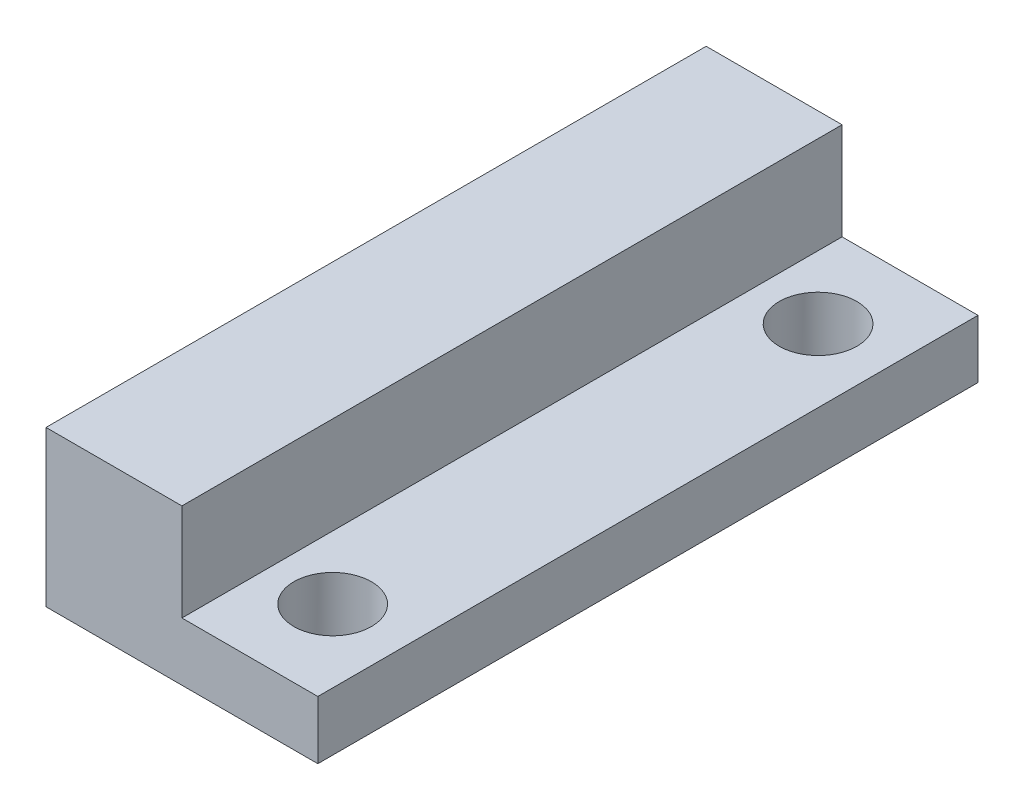
ISO-10303-21;
HEADER;
FILE_DESCRIPTION(('STEP AP214'),'2;1');
FILE_NAME('part.step','',(''),(''),'','','');
FILE_SCHEMA(('AUTOMOTIVE_DESIGN { 1 0 10303 214 1 1 1 1 }'));
ENDSEC;
DATA;
#1=APPLICATION_CONTEXT('core data for automotive mechanical design processes');
#2=APPLICATION_PROTOCOL_DEFINITION('international standard','automotive_design',2000,#1);
#3=PRODUCT_CONTEXT('',#1,'mechanical');
#4=PRODUCT('Part','Part','',(#3));
#5=PRODUCT_RELATED_PRODUCT_CATEGORY('part','',(#4));
#6=PRODUCT_DEFINITION_FORMATION('','',#4);
#7=PRODUCT_DEFINITION_CONTEXT('part definition',#1,'design');
#8=PRODUCT_DEFINITION('design','',#6,#7);
#9=PRODUCT_DEFINITION_SHAPE('','',#8);
#10=(LENGTH_UNIT() NAMED_UNIT(*) SI_UNIT(.MILLI.,.METRE.));
#11=(NAMED_UNIT(*) PLANE_ANGLE_UNIT() SI_UNIT($,.RADIAN.));
#12=(NAMED_UNIT(*) SI_UNIT($,.STERADIAN.) SOLID_ANGLE_UNIT());
#13=UNCERTAINTY_MEASURE_WITH_UNIT(LENGTH_MEASURE(1.E-05),#10,'distance_accuracy_value','');
#14=(GEOMETRIC_REPRESENTATION_CONTEXT(3) GLOBAL_UNCERTAINTY_ASSIGNED_CONTEXT((#13)) GLOBAL_UNIT_ASSIGNED_CONTEXT((#10,
#11,#12)) REPRESENTATION_CONTEXT('',''));
#15=CARTESIAN_POINT('',(0.,0.,0.));
#16=DIRECTION('',(0.,0.,1.));
#17=DIRECTION('',(1.,0.,0.));
#18=AXIS2_PLACEMENT_3D('',#15,#16,#17);
#19=CARTESIAN_POINT('',(0.,3.,0.));
#20=DIRECTION('',(0.,-1.,0.));
#21=DIRECTION('',(0.,0.,-1.));
#22=AXIS2_PLACEMENT_3D('',#19,#20,#21);
#23=PLANE('',#22);
#24=CARTESIAN_POINT('',(3.26328270830345,3.,12.5));
#25=DIRECTION('',(0.,1.,0.));
#26=DIRECTION('',(0.,0.,1.));
#27=AXIS2_PLACEMENT_3D('',#24,#25,#26);
#28=CIRCLE('',#27,2.);
#29=CARTESIAN_POINT('',(3.26328270830345,3.,14.5));
#30=VERTEX_POINT('',#29);
#31=EDGE_CURVE('E126',#30,#30,#28,.T.);
#32=ORIENTED_EDGE('',*,*,#31,.F.);
#33=EDGE_LOOP('',(#32));
#34=FACE_BOUND('',#33,.T.);
#35=CARTESIAN_POINT('',(3.26328270830345,3.,-12.5));
#36=DIRECTION('',(0.,1.,0.));
#37=DIRECTION('',(0.,0.,1.));
#38=AXIS2_PLACEMENT_3D('',#35,#36,#37);
#39=CIRCLE('',#38,2.);
#40=CARTESIAN_POINT('',(3.26328270830345,3.,-10.5));
#41=VERTEX_POINT('',#40);
#42=EDGE_CURVE('E133',#41,#41,#39,.T.);
#43=ORIENTED_EDGE('',*,*,#42,.F.);
#44=EDGE_LOOP('',(#43));
#45=FACE_BOUND('',#44,.T.);
#46=DIRECTION('',(0.,0.,-1.));
#47=VECTOR('',#46,1.);
#48=CARTESIAN_POINT('',(0.,3.,-17.));
#49=LINE('',#48,#47);
#50=CARTESIAN_POINT('',(0.,3.,17.));
#51=VERTEX_POINT('',#50);
#52=CARTESIAN_POINT('',(0.,3.,-17.));
#53=VERTEX_POINT('',#52);
#54=EDGE_CURVE('E57',#51,#53,#49,.T.);
#55=ORIENTED_EDGE('',*,*,#54,.F.);
#56=DIRECTION('',(1.,0.,0.));
#57=VECTOR('',#56,1.);
#58=CARTESIAN_POINT('',(-7.,3.,17.));
#59=LINE('',#58,#57);
#60=CARTESIAN_POINT('',(7.,3.,17.));
#61=VERTEX_POINT('',#60);
#62=EDGE_CURVE('E62',#51,#61,#59,.T.);
#63=ORIENTED_EDGE('',*,*,#62,.T.);
#64=DIRECTION('',(0.,0.,-1.));
#65=VECTOR('',#64,1.);
#66=CARTESIAN_POINT('',(7.,3.,17.));
#67=LINE('',#66,#65);
#68=CARTESIAN_POINT('',(7.,3.,-17.));
#69=VERTEX_POINT('',#68);
#70=EDGE_CURVE('E94',#61,#69,#67,.T.);
#71=ORIENTED_EDGE('',*,*,#70,.T.);
#72=DIRECTION('',(-1.,0.,0.));
#73=VECTOR('',#72,1.);
#74=CARTESIAN_POINT('',(-7.,3.,-17.));
#75=LINE('',#74,#73);
#76=EDGE_CURVE('E163',#69,#53,#75,.T.);
#77=ORIENTED_EDGE('',*,*,#76,.T.);
#78=EDGE_LOOP('',(#55,#63,#71,#77));
#79=FACE_BOUND('',#78,.T.);
#80=ADVANCED_FACE('F39',(#34,#45,#79),#23,.F.);
#81=CARTESIAN_POINT('',(7.,3.,17.));
#82=DIRECTION('',(-1.,0.,0.));
#83=DIRECTION('',(0.,0.,1.));
#84=AXIS2_PLACEMENT_3D('',#81,#82,#83);
#85=PLANE('',#84);
#86=DIRECTION('',(0.,0.,-1.));
#87=VECTOR('',#86,1.);
#88=CARTESIAN_POINT('',(7.,0.,17.));
#89=LINE('',#88,#87);
#90=CARTESIAN_POINT('',(7.,0.,17.));
#91=VERTEX_POINT('',#90);
#92=CARTESIAN_POINT('',(7.,0.,-17.));
#93=VERTEX_POINT('',#92);
#94=EDGE_CURVE('E100',#91,#93,#89,.T.);
#95=ORIENTED_EDGE('',*,*,#94,.T.);
#96=DIRECTION('',(0.,-1.,0.));
#97=VECTOR('',#96,1.);
#98=CARTESIAN_POINT('',(7.,3.,-17.));
#99=LINE('',#98,#97);
#100=EDGE_CURVE('E11',#69,#93,#99,.T.);
#101=ORIENTED_EDGE('',*,*,#100,.F.);
#102=ORIENTED_EDGE('',*,*,#70,.F.);
#103=DIRECTION('',(0.,-1.,0.));
#104=VECTOR('',#103,1.);
#105=CARTESIAN_POINT('',(7.,3.,17.));
#106=LINE('',#105,#104);
#107=EDGE_CURVE('E85',#61,#91,#106,.T.);
#108=ORIENTED_EDGE('',*,*,#107,.T.);
#109=EDGE_LOOP('',(#95,#101,#102,#108));
#110=FACE_BOUND('',#109,.T.);
#111=ADVANCED_FACE('F41',(#110),#85,.F.);
#112=CARTESIAN_POINT('',(-7.,3.,-17.));
#113=DIRECTION('',(0.,0.,1.));
#114=DIRECTION('',(1.,0.,0.));
#115=AXIS2_PLACEMENT_3D('',#112,#113,#114);
#116=PLANE('',#115);
#117=DIRECTION('',(-1.,0.,0.));
#118=VECTOR('',#117,1.);
#119=CARTESIAN_POINT('',(-7.,0.,-17.));
#120=LINE('',#119,#118);
#121=CARTESIAN_POINT('',(-7.,0.,-17.));
#122=VERTEX_POINT('',#121);
#123=EDGE_CURVE('E104',#93,#122,#120,.T.);
#124=ORIENTED_EDGE('',*,*,#123,.T.);
#125=DIRECTION('',(0.,-1.,0.));
#126=VECTOR('',#125,1.);
#127=CARTESIAN_POINT('',(-7.,3.,-17.));
#128=LINE('',#127,#126);
#129=CARTESIAN_POINT('',(-7.,8.,-17.));
#130=VERTEX_POINT('',#129);
#131=EDGE_CURVE('E49',#130,#122,#128,.T.);
#132=ORIENTED_EDGE('',*,*,#131,.F.);
#133=DIRECTION('',(-1.,0.,0.));
#134=VECTOR('',#133,1.);
#135=CARTESIAN_POINT('',(-7.,8.,-17.));
#136=LINE('',#135,#134);
#137=CARTESIAN_POINT('',(0.,8.,-17.));
#138=VERTEX_POINT('',#137);
#139=EDGE_CURVE('E153',#138,#130,#136,.T.);
#140=ORIENTED_EDGE('',*,*,#139,.F.);
#141=DIRECTION('',(0.,-1.,0.));
#142=VECTOR('',#141,1.);
#143=CARTESIAN_POINT('',(0.,8.,-17.));
#144=LINE('',#143,#142);
#145=EDGE_CURVE('E112',#138,#53,#144,.T.);
#146=ORIENTED_EDGE('',*,*,#145,.T.);
#147=ORIENTED_EDGE('',*,*,#76,.F.);
#148=ORIENTED_EDGE('',*,*,#100,.T.);
#149=EDGE_LOOP('',(#124,#132,#140,#146,#147,#148));
#150=FACE_BOUND('',#149,.T.);
#151=ADVANCED_FACE('F176',(#150),#116,.F.);
#152=CARTESIAN_POINT('',(-7.,3.,17.));
#153=DIRECTION('',(1.,0.,0.));
#154=DIRECTION('',(0.,0.,-1.));
#155=AXIS2_PLACEMENT_3D('',#152,#153,#154);
#156=PLANE('',#155);
#157=DIRECTION('',(0.,0.,1.));
#158=VECTOR('',#157,1.);
#159=CARTESIAN_POINT('',(-7.,0.,17.));
#160=LINE('',#159,#158);
#161=CARTESIAN_POINT('',(-7.,0.,17.));
#162=VERTEX_POINT('',#161);
#163=EDGE_CURVE('E95',#122,#162,#160,.T.);
#164=ORIENTED_EDGE('',*,*,#163,.T.);
#165=DIRECTION('',(0.,-1.,0.));
#166=VECTOR('',#165,1.);
#167=CARTESIAN_POINT('',(-7.,3.,17.));
#168=LINE('',#167,#166);
#169=CARTESIAN_POINT('',(-7.,8.,17.));
#170=VERTEX_POINT('',#169);
#171=EDGE_CURVE('E89',#170,#162,#168,.T.);
#172=ORIENTED_EDGE('',*,*,#171,.F.);
#173=DIRECTION('',(0.,0.,1.));
#174=VECTOR('',#173,1.);
#175=CARTESIAN_POINT('',(-7.,8.,-17.));
#176=LINE('',#175,#174);
#177=EDGE_CURVE('E141',#130,#170,#176,.T.);
#178=ORIENTED_EDGE('',*,*,#177,.F.);
#179=ORIENTED_EDGE('',*,*,#131,.T.);
#180=EDGE_LOOP('',(#164,#172,#178,#179));
#181=FACE_BOUND('',#180,.T.);
#182=ADVANCED_FACE('F185',(#181),#156,.F.);
#183=CARTESIAN_POINT('',(-7.,3.,17.));
#184=DIRECTION('',(0.,0.,-1.));
#185=DIRECTION('',(-1.,0.,0.));
#186=AXIS2_PLACEMENT_3D('',#183,#184,#185);
#187=PLANE('',#186);
#188=DIRECTION('',(1.,0.,0.));
#189=VECTOR('',#188,1.);
#190=CARTESIAN_POINT('',(-7.,0.,17.));
#191=LINE('',#190,#189);
#192=EDGE_CURVE('E82',#162,#91,#191,.T.);
#193=ORIENTED_EDGE('',*,*,#192,.T.);
#194=ORIENTED_EDGE('',*,*,#107,.F.);
#195=ORIENTED_EDGE('',*,*,#62,.F.);
#196=DIRECTION('',(0.,-1.,0.));
#197=VECTOR('',#196,1.);
#198=CARTESIAN_POINT('',(0.,8.,17.));
#199=LINE('',#198,#197);
#200=CARTESIAN_POINT('',(0.,8.,17.));
#201=VERTEX_POINT('',#200);
#202=EDGE_CURVE('E106',#201,#51,#199,.T.);
#203=ORIENTED_EDGE('',*,*,#202,.F.);
#204=DIRECTION('',(1.,0.,0.));
#205=VECTOR('',#204,1.);
#206=CARTESIAN_POINT('',(-7.,8.,17.));
#207=LINE('',#206,#205);
#208=EDGE_CURVE('E145',#170,#201,#207,.T.);
#209=ORIENTED_EDGE('',*,*,#208,.F.);
#210=ORIENTED_EDGE('',*,*,#171,.T.);
#211=EDGE_LOOP('',(#193,#194,#195,#203,#209,#210));
#212=FACE_BOUND('',#211,.T.);
#213=ADVANCED_FACE('F84',(#212),#187,.F.);
#214=CARTESIAN_POINT('',(0.,0.,0.));
#215=DIRECTION('',(0.,-1.,0.));
#216=DIRECTION('',(0.,0.,-1.));
#217=AXIS2_PLACEMENT_3D('',#214,#215,#216);
#218=PLANE('',#217);
#219=CARTESIAN_POINT('',(3.26328270830345,0.,12.5));
#220=DIRECTION('',(0.,-1.,0.));
#221=DIRECTION('',(0.,0.,-1.));
#222=AXIS2_PLACEMENT_3D('',#219,#220,#221);
#223=CIRCLE('',#222,2.);
#224=CARTESIAN_POINT('',(3.26328270830345,0.,10.5));
#225=VERTEX_POINT('',#224);
#226=EDGE_CURVE('E43',#225,#225,#223,.T.);
#227=ORIENTED_EDGE('',*,*,#226,.F.);
#228=EDGE_LOOP('',(#227));
#229=FACE_BOUND('',#228,.T.);
#230=CARTESIAN_POINT('',(3.26328270830345,0.,-12.5));
#231=DIRECTION('',(0.,-1.,0.));
#232=DIRECTION('',(0.,0.,-1.));
#233=AXIS2_PLACEMENT_3D('',#230,#231,#232);
#234=CIRCLE('',#233,2.);
#235=CARTESIAN_POINT('',(3.26328270830345,0.,-14.5));
#236=VERTEX_POINT('',#235);
#237=EDGE_CURVE('E123',#236,#236,#234,.T.);
#238=ORIENTED_EDGE('',*,*,#237,.F.);
#239=EDGE_LOOP('',(#238));
#240=FACE_BOUND('',#239,.T.);
#241=ORIENTED_EDGE('',*,*,#94,.F.);
#242=ORIENTED_EDGE('',*,*,#192,.F.);
#243=ORIENTED_EDGE('',*,*,#163,.F.);
#244=ORIENTED_EDGE('',*,*,#123,.F.);
#245=EDGE_LOOP('',(#241,#242,#243,#244));
#246=FACE_BOUND('',#245,.T.);
#247=ADVANCED_FACE('F103',(#229,#240,#246),#218,.T.);
#248=CARTESIAN_POINT('',(0.,8.,-17.));
#249=DIRECTION('',(-1.,0.,0.));
#250=DIRECTION('',(0.,0.,1.));
#251=AXIS2_PLACEMENT_3D('',#248,#249,#250);
#252=PLANE('',#251);
#253=ORIENTED_EDGE('',*,*,#54,.T.);
#254=ORIENTED_EDGE('',*,*,#145,.F.);
#255=DIRECTION('',(0.,0.,-1.));
#256=VECTOR('',#255,1.);
#257=CARTESIAN_POINT('',(0.,8.,-17.));
#258=LINE('',#257,#256);
#259=EDGE_CURVE('E149',#201,#138,#258,.T.);
#260=ORIENTED_EDGE('',*,*,#259,.F.);
#261=ORIENTED_EDGE('',*,*,#202,.T.);
#262=EDGE_LOOP('',(#253,#254,#260,#261));
#263=FACE_BOUND('',#262,.T.);
#264=ADVANCED_FACE('F171',(#263),#252,.F.);
#265=CARTESIAN_POINT('',(0.,8.,0.));
#266=DIRECTION('',(0.,1.,0.));
#267=DIRECTION('',(0.,0.,1.));
#268=AXIS2_PLACEMENT_3D('',#265,#266,#267);
#269=PLANE('',#268);
#270=ORIENTED_EDGE('',*,*,#177,.T.);
#271=ORIENTED_EDGE('',*,*,#208,.T.);
#272=ORIENTED_EDGE('',*,*,#259,.T.);
#273=ORIENTED_EDGE('',*,*,#139,.T.);
#274=EDGE_LOOP('',(#270,#271,#272,#273));
#275=FACE_BOUND('',#274,.T.);
#276=ADVANCED_FACE('F182',(#275),#269,.T.);
#277=CARTESIAN_POINT('',(3.26328270830345,-2.,-12.5));
#278=DIRECTION('',(0.,1.,0.));
#279=DIRECTION('',(0.,0.,1.));
#280=AXIS2_PLACEMENT_3D('',#277,#278,#279);
#281=CYLINDRICAL_SURFACE('',#280,2.);
#282=ORIENTED_EDGE('',*,*,#237,.T.);
#283=EDGE_LOOP('',(#282));
#284=FACE_BOUND('',#283,.T.);
#285=ORIENTED_EDGE('',*,*,#42,.T.);
#286=EDGE_LOOP('',(#285));
#287=FACE_BOUND('',#286,.T.);
#288=ADVANCED_FACE('F215',(#284,#287),#281,.F.);
#289=CARTESIAN_POINT('',(3.26328270830345,-2.,12.5));
#290=DIRECTION('',(0.,1.,0.));
#291=DIRECTION('',(0.,0.,1.));
#292=AXIS2_PLACEMENT_3D('',#289,#290,#291);
#293=CYLINDRICAL_SURFACE('',#292,2.);
#294=ORIENTED_EDGE('',*,*,#226,.T.);
#295=EDGE_LOOP('',(#294));
#296=FACE_BOUND('',#295,.T.);
#297=ORIENTED_EDGE('',*,*,#31,.T.);
#298=EDGE_LOOP('',(#297));
#299=FACE_BOUND('',#298,.T.);
#300=ADVANCED_FACE('F213',(#296,#299),#293,.F.);
#301=CLOSED_SHELL('',(#80,#111,#151,#182,#213,#247,#264,#276,#288,#300));
#302=MANIFOLD_SOLID_BREP('B2',#301);
#303=ADVANCED_BREP_SHAPE_REPRESENTATION('',(#18,#302),#14);
#304=SHAPE_DEFINITION_REPRESENTATION(#9,#303);
ENDSEC;
END-ISO-10303-21;
